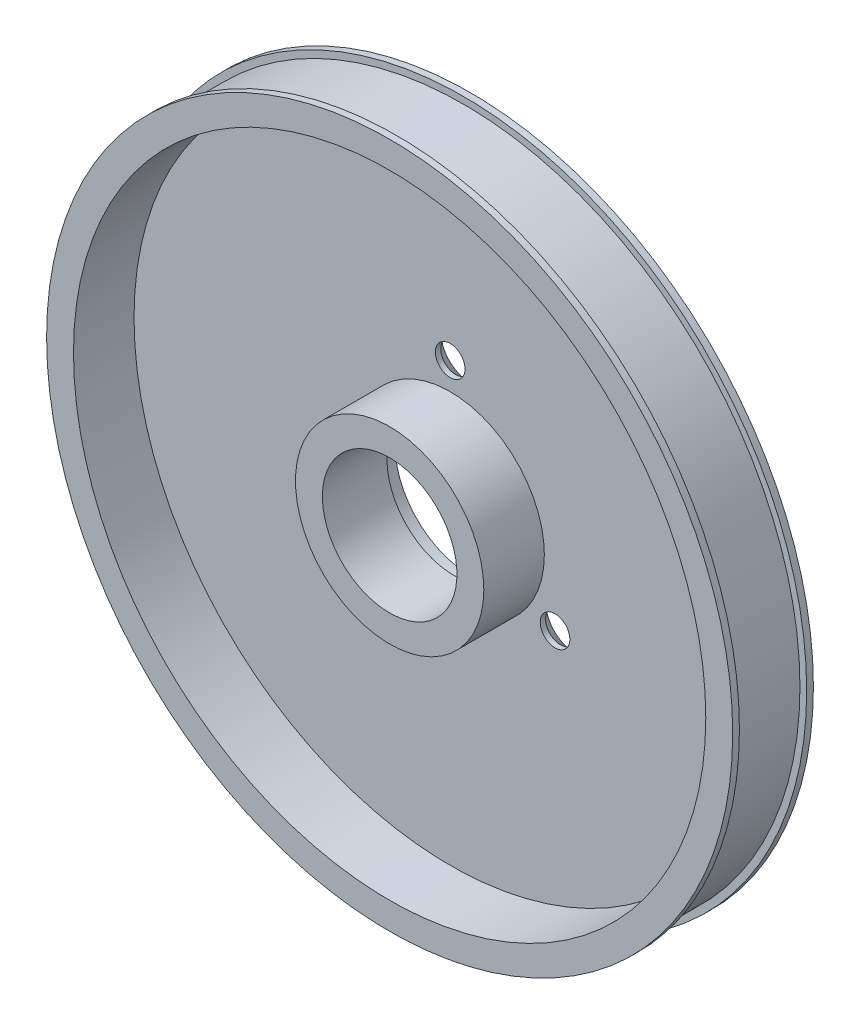
ISO-10303-21;
HEADER;
FILE_DESCRIPTION(('STEP AP214'),'2;1');
FILE_NAME('part.step','',(''),(''),'','','');
FILE_SCHEMA(('AUTOMOTIVE_DESIGN { 1 0 10303 214 1 1 1 1 }'));
ENDSEC;
DATA;
#1=APPLICATION_CONTEXT('core data for automotive mechanical design processes');
#2=APPLICATION_PROTOCOL_DEFINITION('international standard','automotive_design',2000,#1);
#3=PRODUCT_CONTEXT('',#1,'mechanical');
#4=PRODUCT('Part','Part','',(#3));
#5=PRODUCT_RELATED_PRODUCT_CATEGORY('part','',(#4));
#6=PRODUCT_DEFINITION_FORMATION('','',#4);
#7=PRODUCT_DEFINITION_CONTEXT('part definition',#1,'design');
#8=PRODUCT_DEFINITION('design','',#6,#7);
#9=PRODUCT_DEFINITION_SHAPE('','',#8);
#10=(LENGTH_UNIT() NAMED_UNIT(*) SI_UNIT(.MILLI.,.METRE.));
#11=(NAMED_UNIT(*) PLANE_ANGLE_UNIT() SI_UNIT($,.RADIAN.));
#12=(NAMED_UNIT(*) SI_UNIT($,.STERADIAN.) SOLID_ANGLE_UNIT());
#13=UNCERTAINTY_MEASURE_WITH_UNIT(LENGTH_MEASURE(1.E-05),#10,'distance_accuracy_value','');
#14=(GEOMETRIC_REPRESENTATION_CONTEXT(3) GLOBAL_UNCERTAINTY_ASSIGNED_CONTEXT((#13)) GLOBAL_UNIT_ASSIGNED_CONTEXT((#10,
#11,#12)) REPRESENTATION_CONTEXT('',''));
#15=CARTESIAN_POINT('',(0.,0.,0.));
#16=DIRECTION('',(0.,0.,1.));
#17=DIRECTION('',(1.,0.,0.));
#18=AXIS2_PLACEMENT_3D('',#15,#16,#17);
#19=CARTESIAN_POINT('',(0.,0.,0.));
#20=DIRECTION('',(0.,0.,1.));
#21=DIRECTION('',(1.,0.,0.));
#22=AXIS2_PLACEMENT_3D('',#19,#20,#21);
#23=CYLINDRICAL_SURFACE('',#22,25.5);
#24=CARTESIAN_POINT('',(0.,0.,0.));
#25=DIRECTION('',(0.,0.,1.));
#26=DIRECTION('',(1.,0.,0.));
#27=AXIS2_PLACEMENT_3D('',#24,#25,#26);
#28=CIRCLE('',#27,25.5);
#29=CARTESIAN_POINT('',(25.5,0.,0.));
#30=VERTEX_POINT('',#29);
#31=EDGE_CURVE('E10',#30,#30,#28,.T.);
#32=ORIENTED_EDGE('',*,*,#31,.T.);
#33=EDGE_LOOP('',(#32));
#34=FACE_BOUND('',#33,.T.);
#35=CARTESIAN_POINT('',(0.,0.,0.5));
#36=DIRECTION('',(0.,0.,1.));
#37=DIRECTION('',(1.,0.,0.));
#38=AXIS2_PLACEMENT_3D('',#35,#36,#37);
#39=CIRCLE('',#38,25.5);
#40=CARTESIAN_POINT('',(25.5,0.,0.5));
#41=VERTEX_POINT('',#40);
#42=EDGE_CURVE('E80',#41,#41,#39,.T.);
#43=ORIENTED_EDGE('',*,*,#42,.F.);
#44=EDGE_LOOP('',(#43));
#45=FACE_BOUND('',#44,.T.);
#46=ADVANCED_FACE('F30',(#34,#45),#23,.T.);
#47=CARTESIAN_POINT('',(25.5,0.,0.));
#48=DIRECTION('',(0.,0.,-1.));
#49=DIRECTION('',(-1.,0.,0.));
#50=AXIS2_PLACEMENT_3D('',#47,#48,#49);
#51=PLANE('',#50);
#52=CARTESIAN_POINT('',(0.,0.,0.));
#53=DIRECTION('',(0.,0.,-1.));
#54=DIRECTION('',(-1.,0.,0.));
#55=AXIS2_PLACEMENT_3D('',#52,#53,#54);
#56=CIRCLE('',#55,5.59999999999999);
#57=CARTESIAN_POINT('',(-5.59999999999999,0.,0.));
#58=VERTEX_POINT('',#57);
#59=EDGE_CURVE('E184',#58,#58,#56,.T.);
#60=ORIENTED_EDGE('',*,*,#59,.F.);
#61=EDGE_LOOP('',(#60));
#62=FACE_BOUND('',#61,.T.);
#63=CARTESIAN_POINT('',(7.794228634,-4.5,0.));
#64=DIRECTION('',(0.,0.,-1.));
#65=DIRECTION('',(-1.,0.,0.));
#66=AXIS2_PLACEMENT_3D('',#63,#64,#65);
#67=CIRCLE('',#66,2.2);
#68=CARTESIAN_POINT('',(5.594228634,-4.5,0.));
#69=VERTEX_POINT('',#68);
#70=EDGE_CURVE('E194',#69,#69,#67,.T.);
#71=ORIENTED_EDGE('',*,*,#70,.F.);
#72=EDGE_LOOP('',(#71));
#73=FACE_BOUND('',#72,.T.);
#74=CARTESIAN_POINT('',(-7.794228634,-4.5,0.));
#75=DIRECTION('',(0.,0.,-1.));
#76=DIRECTION('',(-1.,0.,0.));
#77=AXIS2_PLACEMENT_3D('',#74,#75,#76);
#78=CIRCLE('',#77,2.2);
#79=CARTESIAN_POINT('',(-9.994228634,-4.5,0.));
#80=VERTEX_POINT('',#79);
#81=EDGE_CURVE('E59',#80,#80,#78,.T.);
#82=ORIENTED_EDGE('',*,*,#81,.F.);
#83=EDGE_LOOP('',(#82));
#84=FACE_BOUND('',#83,.T.);
#85=CARTESIAN_POINT('',(0.,9.,0.));
#86=DIRECTION('',(0.,0.,-1.));
#87=DIRECTION('',(-1.,0.,0.));
#88=AXIS2_PLACEMENT_3D('',#85,#86,#87);
#89=CIRCLE('',#88,2.2);
#90=CARTESIAN_POINT('',(-2.2,9.,0.));
#91=VERTEX_POINT('',#90);
#92=EDGE_CURVE('E52',#91,#91,#89,.T.);
#93=ORIENTED_EDGE('',*,*,#92,.F.);
#94=EDGE_LOOP('',(#93));
#95=FACE_BOUND('',#94,.T.);
#96=ORIENTED_EDGE('',*,*,#31,.F.);
#97=EDGE_LOOP('',(#96));
#98=FACE_BOUND('',#97,.T.);
#99=ADVANCED_FACE('F109',(#62,#73,#84,#95,#98),#51,.T.);
#100=CARTESIAN_POINT('',(0.,0.,6.));
#101=DIRECTION('',(0.,0.,1.));
#102=DIRECTION('',(1.,0.,0.));
#103=AXIS2_PLACEMENT_3D('',#100,#101,#102);
#104=PLANE('',#103);
#105=CARTESIAN_POINT('',(0.,0.,6.));
#106=DIRECTION('',(0.,0.,1.));
#107=DIRECTION('',(1.,0.,0.));
#108=AXIS2_PLACEMENT_3D('',#105,#106,#107);
#109=CIRCLE('',#108,23.5);
#110=CARTESIAN_POINT('',(23.5,0.,6.));
#111=VERTEX_POINT('',#110);
#112=EDGE_CURVE('E74',#111,#111,#109,.T.);
#113=ORIENTED_EDGE('',*,*,#112,.F.);
#114=EDGE_LOOP('',(#113));
#115=FACE_BOUND('',#114,.T.);
#116=CARTESIAN_POINT('',(0.,0.,6.));
#117=DIRECTION('',(0.,0.,1.));
#118=DIRECTION('',(1.,0.,0.));
#119=AXIS2_PLACEMENT_3D('',#116,#117,#118);
#120=CIRCLE('',#119,25.5);
#121=CARTESIAN_POINT('',(25.5,0.,6.));
#122=VERTEX_POINT('',#121);
#123=EDGE_CURVE('E37',#122,#122,#120,.T.);
#124=ORIENTED_EDGE('',*,*,#123,.T.);
#125=EDGE_LOOP('',(#124));
#126=FACE_BOUND('',#125,.T.);
#127=ADVANCED_FACE('F106',(#115,#126),#104,.T.);
#128=CARTESIAN_POINT('',(0.,0.,0.));
#129=DIRECTION('',(0.,0.,1.));
#130=DIRECTION('',(1.,0.,0.));
#131=AXIS2_PLACEMENT_3D('',#128,#129,#130);
#132=CYLINDRICAL_SURFACE('',#131,25.5);
#133=CARTESIAN_POINT('',(0.,0.,5.5));
#134=DIRECTION('',(0.,0.,1.));
#135=DIRECTION('',(1.,0.,0.));
#136=AXIS2_PLACEMENT_3D('',#133,#134,#135);
#137=CIRCLE('',#136,25.5);
#138=CARTESIAN_POINT('',(25.5,0.,5.5));
#139=VERTEX_POINT('',#138);
#140=EDGE_CURVE('E42',#139,#139,#137,.T.);
#141=ORIENTED_EDGE('',*,*,#140,.T.);
#142=EDGE_LOOP('',(#141));
#143=FACE_BOUND('',#142,.T.);
#144=ORIENTED_EDGE('',*,*,#123,.F.);
#145=EDGE_LOOP('',(#144));
#146=FACE_BOUND('',#145,.T.);
#147=ADVANCED_FACE('F91',(#143,#146),#132,.T.);
#148=CARTESIAN_POINT('',(25.5,0.,5.5));
#149=DIRECTION('',(0.,0.,-1.));
#150=DIRECTION('',(-1.,0.,0.));
#151=AXIS2_PLACEMENT_3D('',#148,#149,#150);
#152=PLANE('',#151);
#153=CARTESIAN_POINT('',(0.,0.,5.5));
#154=DIRECTION('',(0.,0.,1.));
#155=DIRECTION('',(1.,0.,0.));
#156=AXIS2_PLACEMENT_3D('',#153,#154,#155);
#157=CIRCLE('',#156,25.);
#158=CARTESIAN_POINT('',(25.,0.,5.5));
#159=VERTEX_POINT('',#158);
#160=EDGE_CURVE('E86',#159,#159,#157,.T.);
#161=ORIENTED_EDGE('',*,*,#160,.T.);
#162=EDGE_LOOP('',(#161));
#163=FACE_BOUND('',#162,.T.);
#164=ORIENTED_EDGE('',*,*,#140,.F.);
#165=EDGE_LOOP('',(#164));
#166=FACE_BOUND('',#165,.T.);
#167=ADVANCED_FACE('F94',(#163,#166),#152,.T.);
#168=CARTESIAN_POINT('',(0.,0.,0.));
#169=DIRECTION('',(0.,0.,1.));
#170=DIRECTION('',(1.,0.,0.));
#171=AXIS2_PLACEMENT_3D('',#168,#169,#170);
#172=CYLINDRICAL_SURFACE('',#171,25.);
#173=CARTESIAN_POINT('',(0.,0.,0.5));
#174=DIRECTION('',(0.,0.,1.));
#175=DIRECTION('',(1.,0.,0.));
#176=AXIS2_PLACEMENT_3D('',#173,#174,#175);
#177=CIRCLE('',#176,25.);
#178=CARTESIAN_POINT('',(25.,0.,0.5));
#179=VERTEX_POINT('',#178);
#180=EDGE_CURVE('E83',#179,#179,#177,.T.);
#181=ORIENTED_EDGE('',*,*,#180,.T.);
#182=EDGE_LOOP('',(#181));
#183=FACE_BOUND('',#182,.T.);
#184=ORIENTED_EDGE('',*,*,#160,.F.);
#185=EDGE_LOOP('',(#184));
#186=FACE_BOUND('',#185,.T.);
#187=ADVANCED_FACE('F96',(#183,#186),#172,.T.);
#188=CARTESIAN_POINT('',(25.,0.,0.5));
#189=DIRECTION('',(0.,0.,1.));
#190=DIRECTION('',(1.,0.,0.));
#191=AXIS2_PLACEMENT_3D('',#188,#189,#190);
#192=PLANE('',#191);
#193=ORIENTED_EDGE('',*,*,#42,.T.);
#194=EDGE_LOOP('',(#193));
#195=FACE_BOUND('',#194,.T.);
#196=ORIENTED_EDGE('',*,*,#180,.F.);
#197=EDGE_LOOP('',(#196));
#198=FACE_BOUND('',#197,.T.);
#199=ADVANCED_FACE('F103',(#195,#198),#192,.T.);
#200=CARTESIAN_POINT('',(0.,0.,1.50000000000004));
#201=DIRECTION('',(0.,0.,-1.));
#202=DIRECTION('',(-1.,0.,0.));
#203=AXIS2_PLACEMENT_3D('',#200,#201,#202);
#204=PLANE('',#203);
#205=CARTESIAN_POINT('',(7.794228634,-4.5,1.50000000000004));
#206=DIRECTION('',(0.,0.,-1.));
#207=DIRECTION('',(-1.,0.,0.));
#208=AXIS2_PLACEMENT_3D('',#205,#206,#207);
#209=CIRCLE('',#208,1.09999999999999);
#210=CARTESIAN_POINT('',(6.69422863400001,-4.5,1.50000000000004));
#211=VERTEX_POINT('',#210);
#212=EDGE_CURVE('E33',#211,#211,#209,.T.);
#213=ORIENTED_EDGE('',*,*,#212,.T.);
#214=EDGE_LOOP('',(#213));
#215=FACE_BOUND('',#214,.T.);
#216=CARTESIAN_POINT('',(-7.794228634,-4.5,1.50000000000004));
#217=DIRECTION('',(0.,0.,-1.));
#218=DIRECTION('',(-1.,0.,0.));
#219=AXIS2_PLACEMENT_3D('',#216,#217,#218);
#220=CIRCLE('',#219,1.09999999999999);
#221=CARTESIAN_POINT('',(-8.89422863399999,-4.5,1.50000000000004));
#222=VERTEX_POINT('',#221);
#223=EDGE_CURVE('E50',#222,#222,#220,.T.);
#224=ORIENTED_EDGE('',*,*,#223,.T.);
#225=EDGE_LOOP('',(#224));
#226=FACE_BOUND('',#225,.T.);
#227=CARTESIAN_POINT('',(0.,9.,1.50000000000004));
#228=DIRECTION('',(0.,0.,-1.));
#229=DIRECTION('',(-1.,0.,0.));
#230=AXIS2_PLACEMENT_3D('',#227,#228,#229);
#231=CIRCLE('',#230,1.09999999999999);
#232=CARTESIAN_POINT('',(-1.09999999999999,9.,1.50000000000004));
#233=VERTEX_POINT('',#232);
#234=EDGE_CURVE('E46',#233,#233,#231,.T.);
#235=ORIENTED_EDGE('',*,*,#234,.T.);
#236=EDGE_LOOP('',(#235));
#237=FACE_BOUND('',#236,.T.);
#238=CARTESIAN_POINT('',(0.,0.,1.5));
#239=DIRECTION('',(0.,0.,1.));
#240=DIRECTION('',(1.,0.,0.));
#241=AXIS2_PLACEMENT_3D('',#238,#239,#240);
#242=CIRCLE('',#241,7.);
#243=CARTESIAN_POINT('',(7.,0.,1.5));
#244=VERTEX_POINT('',#243);
#245=EDGE_CURVE('E71',#244,#244,#242,.T.);
#246=ORIENTED_EDGE('',*,*,#245,.F.);
#247=EDGE_LOOP('',(#246));
#248=FACE_BOUND('',#247,.T.);
#249=CARTESIAN_POINT('',(0.,0.,1.5));
#250=DIRECTION('',(0.,0.,1.));
#251=DIRECTION('',(1.,0.,0.));
#252=AXIS2_PLACEMENT_3D('',#249,#250,#251);
#253=CIRCLE('',#252,23.5);
#254=CARTESIAN_POINT('',(23.5,0.,1.5));
#255=VERTEX_POINT('',#254);
#256=EDGE_CURVE('E77',#255,#255,#253,.T.);
#257=ORIENTED_EDGE('',*,*,#256,.T.);
#258=EDGE_LOOP('',(#257));
#259=FACE_BOUND('',#258,.T.);
#260=ADVANCED_FACE('F119',(#215,#226,#237,#248,#259),#204,.F.);
#261=CARTESIAN_POINT('',(0.,0.,6.));
#262=DIRECTION('',(0.,0.,1.));
#263=DIRECTION('',(1.,0.,0.));
#264=AXIS2_PLACEMENT_3D('',#261,#262,#263);
#265=CYLINDRICAL_SURFACE('',#264,23.5);
#266=ORIENTED_EDGE('',*,*,#256,.F.);
#267=EDGE_LOOP('',(#266));
#268=FACE_BOUND('',#267,.T.);
#269=ORIENTED_EDGE('',*,*,#112,.T.);
#270=EDGE_LOOP('',(#269));
#271=FACE_BOUND('',#270,.T.);
#272=ADVANCED_FACE('F127',(#268,#271),#265,.F.);
#273=CARTESIAN_POINT('',(0.,0.,1.5));
#274=DIRECTION('',(0.,0.,1.));
#275=DIRECTION('',(1.,0.,0.));
#276=AXIS2_PLACEMENT_3D('',#273,#274,#275);
#277=CYLINDRICAL_SURFACE('',#276,7.);
#278=ORIENTED_EDGE('',*,*,#245,.T.);
#279=EDGE_LOOP('',(#278));
#280=FACE_BOUND('',#279,.T.);
#281=CARTESIAN_POINT('',(0.,0.,6.));
#282=DIRECTION('',(0.,0.,1.));
#283=DIRECTION('',(1.,0.,0.));
#284=AXIS2_PLACEMENT_3D('',#281,#282,#283);
#285=CIRCLE('',#284,7.);
#286=CARTESIAN_POINT('',(7.,0.,6.));
#287=VERTEX_POINT('',#286);
#288=EDGE_CURVE('E48',#287,#287,#285,.T.);
#289=ORIENTED_EDGE('',*,*,#288,.F.);
#290=EDGE_LOOP('',(#289));
#291=FACE_BOUND('',#290,.T.);
#292=ADVANCED_FACE('F133',(#280,#291),#277,.T.);
#293=CARTESIAN_POINT('',(0.,0.,6.));
#294=DIRECTION('',(0.,0.,1.));
#295=DIRECTION('',(1.,0.,0.));
#296=AXIS2_PLACEMENT_3D('',#293,#294,#295);
#297=PLANE('',#296);
#298=CARTESIAN_POINT('',(0.,0.,6.00000000000001));
#299=DIRECTION('',(0.,0.,-1.));
#300=DIRECTION('',(-1.,0.,0.));
#301=AXIS2_PLACEMENT_3D('',#298,#299,#300);
#302=CIRCLE('',#301,5.00000000000001);
#303=CARTESIAN_POINT('',(-5.00000000000001,0.,6.00000000000001));
#304=VERTEX_POINT('',#303);
#305=EDGE_CURVE('E191',#304,#304,#302,.T.);
#306=ORIENTED_EDGE('',*,*,#305,.T.);
#307=EDGE_LOOP('',(#306));
#308=FACE_BOUND('',#307,.T.);
#309=ORIENTED_EDGE('',*,*,#288,.T.);
#310=EDGE_LOOP('',(#309));
#311=FACE_BOUND('',#310,.T.);
#312=ADVANCED_FACE('F137',(#308,#311),#297,.T.);
#313=CARTESIAN_POINT('',(0.,9.,0.));
#314=DIRECTION('',(0.,0.,-1.));
#315=DIRECTION('',(-1.,0.,0.));
#316=AXIS2_PLACEMENT_3D('',#313,#314,#315);
#317=CYLINDRICAL_SURFACE('',#316,1.09999999999999);
#318=CARTESIAN_POINT('',(0.,9.,1.09999999999999));
#319=DIRECTION('',(0.,0.,-1.));
#320=DIRECTION('',(-1.,0.,0.));
#321=AXIS2_PLACEMENT_3D('',#318,#319,#320);
#322=CIRCLE('',#321,1.09999999999999);
#323=CARTESIAN_POINT('',(-1.09999999999999,9.,1.09999999999999));
#324=VERTEX_POINT('',#323);
#325=EDGE_CURVE('E49',#324,#324,#322,.T.);
#326=ORIENTED_EDGE('',*,*,#325,.T.);
#327=EDGE_LOOP('',(#326));
#328=FACE_BOUND('',#327,.T.);
#329=ORIENTED_EDGE('',*,*,#234,.F.);
#330=EDGE_LOOP('',(#329));
#331=FACE_BOUND('',#330,.T.);
#332=ADVANCED_FACE('F141',(#328,#331),#317,.F.);
#333=CARTESIAN_POINT('',(0.,9.,0.));
#334=DIRECTION('',(0.,0.,-1.));
#335=DIRECTION('',(-1.,0.,0.));
#336=AXIS2_PLACEMENT_3D('',#333,#334,#335);
#337=CONICAL_SURFACE('',#336,2.2,0.785398163397458);
#338=ORIENTED_EDGE('',*,*,#325,.F.);
#339=EDGE_LOOP('',(#338));
#340=FACE_BOUND('',#339,.T.);
#341=ORIENTED_EDGE('',*,*,#92,.T.);
#342=EDGE_LOOP('',(#341));
#343=FACE_BOUND('',#342,.T.);
#344=ADVANCED_FACE('F145',(#340,#343),#337,.F.);
#345=CARTESIAN_POINT('',(-7.794228634,-4.5,0.));
#346=DIRECTION('',(0.,0.,-1.));
#347=DIRECTION('',(-1.,0.,0.));
#348=AXIS2_PLACEMENT_3D('',#345,#346,#347);
#349=CYLINDRICAL_SURFACE('',#348,1.09999999999999);
#350=CARTESIAN_POINT('',(-7.794228634,-4.5,1.09999999999999));
#351=DIRECTION('',(0.,0.,-1.));
#352=DIRECTION('',(-1.,0.,0.));
#353=AXIS2_PLACEMENT_3D('',#350,#351,#352);
#354=CIRCLE('',#353,1.09999999999999);
#355=CARTESIAN_POINT('',(-8.89422863399999,-4.5,1.09999999999999));
#356=VERTEX_POINT('',#355);
#357=EDGE_CURVE('E53',#356,#356,#354,.T.);
#358=ORIENTED_EDGE('',*,*,#357,.T.);
#359=EDGE_LOOP('',(#358));
#360=FACE_BOUND('',#359,.T.);
#361=ORIENTED_EDGE('',*,*,#223,.F.);
#362=EDGE_LOOP('',(#361));
#363=FACE_BOUND('',#362,.T.);
#364=ADVANCED_FACE('F149',(#360,#363),#349,.F.);
#365=CARTESIAN_POINT('',(-7.794228634,-4.5,0.));
#366=DIRECTION('',(0.,0.,-1.));
#367=DIRECTION('',(-1.,0.,0.));
#368=AXIS2_PLACEMENT_3D('',#365,#366,#367);
#369=CONICAL_SURFACE('',#368,2.2,0.785398163397458);
#370=ORIENTED_EDGE('',*,*,#357,.F.);
#371=EDGE_LOOP('',(#370));
#372=FACE_BOUND('',#371,.T.);
#373=ORIENTED_EDGE('',*,*,#81,.T.);
#374=EDGE_LOOP('',(#373));
#375=FACE_BOUND('',#374,.T.);
#376=ADVANCED_FACE('F153',(#372,#375),#369,.F.);
#377=CARTESIAN_POINT('',(7.794228634,-4.5,0.));
#378=DIRECTION('',(0.,0.,-1.));
#379=DIRECTION('',(-1.,0.,0.));
#380=AXIS2_PLACEMENT_3D('',#377,#378,#379);
#381=CYLINDRICAL_SURFACE('',#380,1.09999999999999);
#382=CARTESIAN_POINT('',(7.794228634,-4.5,1.09999999999999));
#383=DIRECTION('',(0.,0.,-1.));
#384=DIRECTION('',(-1.,0.,0.));
#385=AXIS2_PLACEMENT_3D('',#382,#383,#384);
#386=CIRCLE('',#385,1.09999999999999);
#387=CARTESIAN_POINT('',(6.69422863400001,-4.5,1.09999999999999));
#388=VERTEX_POINT('',#387);
#389=EDGE_CURVE('E196',#388,#388,#386,.T.);
#390=ORIENTED_EDGE('',*,*,#389,.T.);
#391=EDGE_LOOP('',(#390));
#392=FACE_BOUND('',#391,.T.);
#393=ORIENTED_EDGE('',*,*,#212,.F.);
#394=EDGE_LOOP('',(#393));
#395=FACE_BOUND('',#394,.T.);
#396=ADVANCED_FACE('F156',(#392,#395),#381,.F.);
#397=CARTESIAN_POINT('',(7.794228634,-4.5,0.));
#398=DIRECTION('',(0.,0.,-1.));
#399=DIRECTION('',(-1.,0.,0.));
#400=AXIS2_PLACEMENT_3D('',#397,#398,#399);
#401=CONICAL_SURFACE('',#400,2.2,0.785398163397458);
#402=ORIENTED_EDGE('',*,*,#389,.F.);
#403=EDGE_LOOP('',(#402));
#404=FACE_BOUND('',#403,.T.);
#405=ORIENTED_EDGE('',*,*,#70,.T.);
#406=EDGE_LOOP('',(#405));
#407=FACE_BOUND('',#406,.T.);
#408=ADVANCED_FACE('F160',(#404,#407),#401,.F.);
#409=CARTESIAN_POINT('',(0.,0.,0.));
#410=DIRECTION('',(0.,0.,-1.));
#411=DIRECTION('',(-1.,0.,0.));
#412=AXIS2_PLACEMENT_3D('',#409,#410,#411);
#413=CYLINDRICAL_SURFACE('',#412,5.00000000000001);
#414=ORIENTED_EDGE('',*,*,#305,.F.);
#415=EDGE_LOOP('',(#414));
#416=FACE_BOUND('',#415,.T.);
#417=CARTESIAN_POINT('',(0.,0.,1.2));
#418=DIRECTION('',(0.,0.,-1.));
#419=DIRECTION('',(-1.,0.,0.));
#420=AXIS2_PLACEMENT_3D('',#417,#418,#419);
#421=CIRCLE('',#420,5.00000000000001);
#422=CARTESIAN_POINT('',(-5.00000000000001,0.,1.2));
#423=VERTEX_POINT('',#422);
#424=EDGE_CURVE('E186',#423,#423,#421,.T.);
#425=ORIENTED_EDGE('',*,*,#424,.T.);
#426=EDGE_LOOP('',(#425));
#427=FACE_BOUND('',#426,.T.);
#428=ADVANCED_FACE('F164',(#416,#427),#413,.F.);
#429=CARTESIAN_POINT('',(5.00000000000001,0.,1.2));
#430=DIRECTION('',(0.,0.,1.));
#431=DIRECTION('',(1.,0.,0.));
#432=AXIS2_PLACEMENT_3D('',#429,#430,#431);
#433=PLANE('',#432);
#434=ORIENTED_EDGE('',*,*,#424,.F.);
#435=EDGE_LOOP('',(#434));
#436=FACE_BOUND('',#435,.T.);
#437=CARTESIAN_POINT('',(0.,0.,1.2));
#438=DIRECTION('',(0.,0.,-1.));
#439=DIRECTION('',(-1.,0.,0.));
#440=AXIS2_PLACEMENT_3D('',#437,#438,#439);
#441=CIRCLE('',#440,5.59999999999999);
#442=CARTESIAN_POINT('',(-5.59999999999999,0.,1.2));
#443=VERTEX_POINT('',#442);
#444=EDGE_CURVE('E181',#443,#443,#441,.T.);
#445=ORIENTED_EDGE('',*,*,#444,.T.);
#446=EDGE_LOOP('',(#445));
#447=FACE_BOUND('',#446,.T.);
#448=ADVANCED_FACE('F168',(#436,#447),#433,.F.);
#449=CARTESIAN_POINT('',(0.,0.,0.));
#450=DIRECTION('',(0.,0.,-1.));
#451=DIRECTION('',(-1.,0.,0.));
#452=AXIS2_PLACEMENT_3D('',#449,#450,#451);
#453=CYLINDRICAL_SURFACE('',#452,5.59999999999999);
#454=ORIENTED_EDGE('',*,*,#444,.F.);
#455=EDGE_LOOP('',(#454));
#456=FACE_BOUND('',#455,.T.);
#457=ORIENTED_EDGE('',*,*,#59,.T.);
#458=EDGE_LOOP('',(#457));
#459=FACE_BOUND('',#458,.T.);
#460=ADVANCED_FACE('F172',(#456,#459),#453,.F.);
#461=CLOSED_SHELL('',(#46,#99,#127,#147,#167,#187,#199,#260,#272,#292,#312,#332,#344,#364,#376,
#396,#408,#428,#448,#460));
#462=MANIFOLD_SOLID_BREP('B2',#461);
#463=ADVANCED_BREP_SHAPE_REPRESENTATION('',(#18,#462),#14);
#464=SHAPE_DEFINITION_REPRESENTATION(#9,#463);
ENDSEC;
END-ISO-10303-21;
